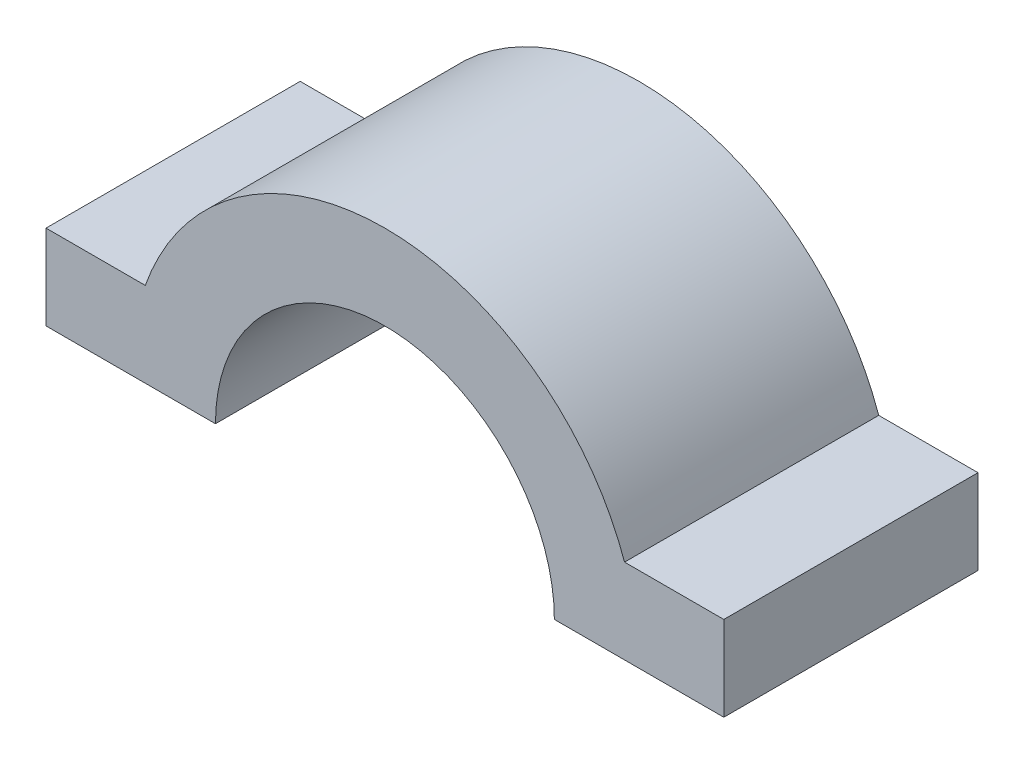
ISO-10303-21;
HEADER;
FILE_DESCRIPTION(('STEP AP214'),'2;1');
FILE_NAME('part.step','',(''),(''),'','','');
FILE_SCHEMA(('AUTOMOTIVE_DESIGN { 1 0 10303 214 1 1 1 1 }'));
ENDSEC;
DATA;
#1=APPLICATION_CONTEXT('core data for automotive mechanical design processes');
#2=APPLICATION_PROTOCOL_DEFINITION('international standard','automotive_design',2000,#1);
#3=PRODUCT_CONTEXT('',#1,'mechanical');
#4=PRODUCT('Part','Part','',(#3));
#5=PRODUCT_RELATED_PRODUCT_CATEGORY('part','',(#4));
#6=PRODUCT_DEFINITION_FORMATION('','',#4);
#7=PRODUCT_DEFINITION_CONTEXT('part definition',#1,'design');
#8=PRODUCT_DEFINITION('design','',#6,#7);
#9=PRODUCT_DEFINITION_SHAPE('','',#8);
#10=(LENGTH_UNIT() NAMED_UNIT(*) SI_UNIT(.MILLI.,.METRE.));
#11=(NAMED_UNIT(*) PLANE_ANGLE_UNIT() SI_UNIT($,.RADIAN.));
#12=(NAMED_UNIT(*) SI_UNIT($,.STERADIAN.) SOLID_ANGLE_UNIT());
#13=UNCERTAINTY_MEASURE_WITH_UNIT(LENGTH_MEASURE(1.E-05),#10,'distance_accuracy_value','');
#14=(GEOMETRIC_REPRESENTATION_CONTEXT(3) GLOBAL_UNCERTAINTY_ASSIGNED_CONTEXT((#13)) GLOBAL_UNIT_ASSIGNED_CONTEXT((#10,
#11,#12)) REPRESENTATION_CONTEXT('',''));
#15=CARTESIAN_POINT('',(0.,0.,0.));
#16=DIRECTION('',(0.,0.,1.));
#17=DIRECTION('',(1.,0.,0.));
#18=AXIS2_PLACEMENT_3D('',#15,#16,#17);
#19=CARTESIAN_POINT('',(0.,15.,15.));
#20=DIRECTION('',(0.,0.,-1.));
#21=DIRECTION('',(-1.,0.,0.));
#22=AXIS2_PLACEMENT_3D('',#19,#20,#21);
#23=PLANE('',#22);
#24=CARTESIAN_POINT('',(20.,0.,15.));
#25=DIRECTION('',(0.,0.,1.));
#26=DIRECTION('',(1.,0.,0.));
#27=AXIS2_PLACEMENT_3D('',#24,#25,#26);
#28=CIRCLE('',#27,15.);
#29=CARTESIAN_POINT('',(34.142135623731,5.,15.));
#30=VERTEX_POINT('',#29);
#31=CARTESIAN_POINT('',(5.85786437626904,5.,15.));
#32=VERTEX_POINT('',#31);
#33=EDGE_CURVE('E83',#30,#32,#28,.T.);
#34=ORIENTED_EDGE('',*,*,#33,.T.);
#35=DIRECTION('',(1.,0.,0.));
#36=VECTOR('',#35,1.);
#37=CARTESIAN_POINT('',(0.,5.,15.));
#38=LINE('',#37,#36);
#39=CARTESIAN_POINT('',(0.,5.,15.));
#40=VERTEX_POINT('',#39);
#41=EDGE_CURVE('E135',#40,#32,#38,.T.);
#42=ORIENTED_EDGE('',*,*,#41,.F.);
#43=DIRECTION('',(0.,-1.,0.));
#44=VECTOR('',#43,1.);
#45=CARTESIAN_POINT('',(0.,15.,15.));
#46=LINE('',#45,#44);
#47=CARTESIAN_POINT('',(0.,0.,15.));
#48=VERTEX_POINT('',#47);
#49=EDGE_CURVE('E12',#40,#48,#46,.T.);
#50=ORIENTED_EDGE('',*,*,#49,.T.);
#51=DIRECTION('',(1.,0.,0.));
#52=VECTOR('',#51,1.);
#53=CARTESIAN_POINT('',(0.,0.,15.));
#54=LINE('',#53,#52);
#55=CARTESIAN_POINT('',(10.,0.,15.));
#56=VERTEX_POINT('',#55);
#57=EDGE_CURVE('E169',#48,#56,#54,.T.);
#58=ORIENTED_EDGE('',*,*,#57,.T.);
#59=CARTESIAN_POINT('',(20.,0.,15.));
#60=DIRECTION('',(0.,0.,1.));
#61=DIRECTION('',(1.,0.,0.));
#62=AXIS2_PLACEMENT_3D('',#59,#60,#61);
#63=CIRCLE('',#62,10.);
#64=CARTESIAN_POINT('',(30.,0.,15.));
#65=VERTEX_POINT('',#64);
#66=EDGE_CURVE('E128',#65,#56,#63,.T.);
#67=ORIENTED_EDGE('',*,*,#66,.F.);
#68=CARTESIAN_POINT('',(40.,0.,15.));
#69=VERTEX_POINT('',#68);
#70=EDGE_CURVE('E168',#65,#69,#54,.T.);
#71=ORIENTED_EDGE('',*,*,#70,.T.);
#72=DIRECTION('',(0.,-1.,0.));
#73=VECTOR('',#72,1.);
#74=CARTESIAN_POINT('',(40.,15.,15.));
#75=LINE('',#74,#73);
#76=CARTESIAN_POINT('',(40.,5.,15.));
#77=VERTEX_POINT('',#76);
#78=EDGE_CURVE('E68',#77,#69,#75,.T.);
#79=ORIENTED_EDGE('',*,*,#78,.F.);
#80=DIRECTION('',(1.,0.,0.));
#81=VECTOR('',#80,1.);
#82=CARTESIAN_POINT('',(40.,5.,15.));
#83=LINE('',#82,#81);
#84=EDGE_CURVE('E158',#30,#77,#83,.T.);
#85=ORIENTED_EDGE('',*,*,#84,.F.);
#86=EDGE_LOOP('',(#34,#42,#50,#58,#67,#71,#79,#85));
#87=FACE_BOUND('',#86,.T.);
#88=ADVANCED_FACE('F59',(#87),#23,.F.);
#89=CARTESIAN_POINT('',(0.,15.,0.));
#90=DIRECTION('',(0.,0.,1.));
#91=DIRECTION('',(1.,0.,0.));
#92=AXIS2_PLACEMENT_3D('',#89,#90,#91);
#93=PLANE('',#92);
#94=DIRECTION('',(1.,0.,0.));
#95=VECTOR('',#94,1.);
#96=CARTESIAN_POINT('',(0.,5.,0.));
#97=LINE('',#96,#95);
#98=CARTESIAN_POINT('',(0.,5.,0.));
#99=VERTEX_POINT('',#98);
#100=CARTESIAN_POINT('',(5.85786437626904,5.,0.));
#101=VERTEX_POINT('',#100);
#102=EDGE_CURVE('E132',#99,#101,#97,.T.);
#103=ORIENTED_EDGE('',*,*,#102,.T.);
#104=CARTESIAN_POINT('',(20.,0.,0.));
#105=DIRECTION('',(0.,0.,1.));
#106=DIRECTION('',(1.,0.,0.));
#107=AXIS2_PLACEMENT_3D('',#104,#105,#106);
#108=CIRCLE('',#107,15.);
#109=CARTESIAN_POINT('',(34.142135623731,5.,0.));
#110=VERTEX_POINT('',#109);
#111=EDGE_CURVE('E75',#110,#101,#108,.T.);
#112=ORIENTED_EDGE('',*,*,#111,.F.);
#113=DIRECTION('',(1.,0.,0.));
#114=VECTOR('',#113,1.);
#115=CARTESIAN_POINT('',(40.,5.,0.));
#116=LINE('',#115,#114);
#117=CARTESIAN_POINT('',(40.,5.,0.));
#118=VERTEX_POINT('',#117);
#119=EDGE_CURVE('E155',#110,#118,#116,.T.);
#120=ORIENTED_EDGE('',*,*,#119,.T.);
#121=DIRECTION('',(0.,-1.,0.));
#122=VECTOR('',#121,1.);
#123=CARTESIAN_POINT('',(40.,15.,0.));
#124=LINE('',#123,#122);
#125=CARTESIAN_POINT('',(40.,0.,0.));
#126=VERTEX_POINT('',#125);
#127=EDGE_CURVE('E184',#118,#126,#124,.T.);
#128=ORIENTED_EDGE('',*,*,#127,.T.);
#129=DIRECTION('',(-1.,0.,0.));
#130=VECTOR('',#129,1.);
#131=CARTESIAN_POINT('',(0.,0.,0.));
#132=LINE('',#131,#130);
#133=CARTESIAN_POINT('',(30.,0.,0.));
#134=VERTEX_POINT('',#133);
#135=EDGE_CURVE('E178',#126,#134,#132,.T.);
#136=ORIENTED_EDGE('',*,*,#135,.T.);
#137=CARTESIAN_POINT('',(20.,0.,0.));
#138=DIRECTION('',(0.,0.,1.));
#139=DIRECTION('',(1.,0.,0.));
#140=AXIS2_PLACEMENT_3D('',#137,#138,#139);
#141=CIRCLE('',#140,10.);
#142=CARTESIAN_POINT('',(10.,0.,0.));
#143=VERTEX_POINT('',#142);
#144=EDGE_CURVE('E202',#134,#143,#141,.T.);
#145=ORIENTED_EDGE('',*,*,#144,.T.);
#146=CARTESIAN_POINT('',(0.,0.,0.));
#147=VERTEX_POINT('',#146);
#148=EDGE_CURVE('E177',#143,#147,#132,.T.);
#149=ORIENTED_EDGE('',*,*,#148,.T.);
#150=DIRECTION('',(0.,-1.,0.));
#151=VECTOR('',#150,1.);
#152=CARTESIAN_POINT('',(0.,15.,0.));
#153=LINE('',#152,#151);
#154=EDGE_CURVE('E141',#99,#147,#153,.T.);
#155=ORIENTED_EDGE('',*,*,#154,.F.);
#156=EDGE_LOOP('',(#103,#112,#120,#128,#136,#145,#149,#155));
#157=FACE_BOUND('',#156,.T.);
#158=ADVANCED_FACE('F139',(#157),#93,.F.);
#159=CARTESIAN_POINT('',(0.,0.,0.));
#160=DIRECTION('',(0.,1.,0.));
#161=DIRECTION('',(0.,0.,1.));
#162=AXIS2_PLACEMENT_3D('',#159,#160,#161);
#163=PLANE('',#162);
#164=ORIENTED_EDGE('',*,*,#148,.F.);
#165=DIRECTION('',(0.,0.,1.));
#166=VECTOR('',#165,1.);
#167=CARTESIAN_POINT('',(10.,0.,0.));
#168=LINE('',#167,#166);
#169=EDGE_CURVE('E161',#143,#56,#168,.T.);
#170=ORIENTED_EDGE('',*,*,#169,.T.);
#171=ORIENTED_EDGE('',*,*,#57,.F.);
#172=DIRECTION('',(0.,0.,1.));
#173=VECTOR('',#172,1.);
#174=CARTESIAN_POINT('',(0.,0.,0.));
#175=LINE('',#174,#173);
#176=EDGE_CURVE('E147',#147,#48,#175,.T.);
#177=ORIENTED_EDGE('',*,*,#176,.F.);
#178=EDGE_LOOP('',(#164,#170,#171,#177));
#179=FACE_BOUND('',#178,.T.);
#180=ADVANCED_FACE('F222',(#179),#163,.F.);
#181=CARTESIAN_POINT('',(0.,15.,0.));
#182=DIRECTION('',(1.,0.,0.));
#183=DIRECTION('',(0.,0.,-1.));
#184=AXIS2_PLACEMENT_3D('',#181,#182,#183);
#185=PLANE('',#184);
#186=ORIENTED_EDGE('',*,*,#49,.F.);
#187=DIRECTION('',(0.,0.,1.));
#188=VECTOR('',#187,1.);
#189=CARTESIAN_POINT('',(0.,5.,0.));
#190=LINE('',#189,#188);
#191=EDGE_CURVE('E143',#99,#40,#190,.T.);
#192=ORIENTED_EDGE('',*,*,#191,.F.);
#193=ORIENTED_EDGE('',*,*,#154,.T.);
#194=ORIENTED_EDGE('',*,*,#176,.T.);
#195=EDGE_LOOP('',(#186,#192,#193,#194));
#196=FACE_BOUND('',#195,.T.);
#197=ADVANCED_FACE('F61',(#196),#185,.F.);
#198=CARTESIAN_POINT('',(40.,15.,0.));
#199=DIRECTION('',(-1.,0.,0.));
#200=DIRECTION('',(0.,0.,1.));
#201=AXIS2_PLACEMENT_3D('',#198,#199,#200);
#202=PLANE('',#201);
#203=ORIENTED_EDGE('',*,*,#127,.F.);
#204=DIRECTION('',(0.,0.,1.));
#205=VECTOR('',#204,1.);
#206=CARTESIAN_POINT('',(40.,5.,0.));
#207=LINE('',#206,#205);
#208=EDGE_CURVE('E149',#118,#77,#207,.T.);
#209=ORIENTED_EDGE('',*,*,#208,.T.);
#210=ORIENTED_EDGE('',*,*,#78,.T.);
#211=DIRECTION('',(0.,0.,-1.));
#212=VECTOR('',#211,1.);
#213=CARTESIAN_POINT('',(40.,0.,0.));
#214=LINE('',#213,#212);
#215=EDGE_CURVE('E173',#69,#126,#214,.T.);
#216=ORIENTED_EDGE('',*,*,#215,.T.);
#217=EDGE_LOOP('',(#203,#209,#210,#216));
#218=FACE_BOUND('',#217,.T.);
#219=ADVANCED_FACE('F192',(#218),#202,.F.);
#220=ORIENTED_EDGE('',*,*,#70,.F.);
#221=DIRECTION('',(0.,0.,1.));
#222=VECTOR('',#221,1.);
#223=CARTESIAN_POINT('',(30.,0.,0.));
#224=LINE('',#223,#222);
#225=EDGE_CURVE('E152',#134,#65,#224,.T.);
#226=ORIENTED_EDGE('',*,*,#225,.F.);
#227=ORIENTED_EDGE('',*,*,#135,.F.);
#228=ORIENTED_EDGE('',*,*,#215,.F.);
#229=EDGE_LOOP('',(#220,#226,#227,#228));
#230=FACE_BOUND('',#229,.T.);
#231=ADVANCED_FACE('F199',(#230),#163,.F.);
#232=CARTESIAN_POINT('',(40.,5.,0.));
#233=DIRECTION('',(0.,-1.,0.));
#234=DIRECTION('',(0.,0.,-1.));
#235=AXIS2_PLACEMENT_3D('',#232,#233,#234);
#236=PLANE('',#235);
#237=ORIENTED_EDGE('',*,*,#119,.F.);
#238=DIRECTION('',(0.,0.,1.));
#239=VECTOR('',#238,1.);
#240=CARTESIAN_POINT('',(34.142135623731,5.,0.));
#241=LINE('',#240,#239);
#242=EDGE_CURVE('E126',#110,#30,#241,.T.);
#243=ORIENTED_EDGE('',*,*,#242,.T.);
#244=ORIENTED_EDGE('',*,*,#84,.T.);
#245=ORIENTED_EDGE('',*,*,#208,.F.);
#246=EDGE_LOOP('',(#237,#243,#244,#245));
#247=FACE_BOUND('',#246,.T.);
#248=ADVANCED_FACE('F205',(#247),#236,.F.);
#249=CARTESIAN_POINT('',(0.,5.,0.));
#250=DIRECTION('',(0.,-1.,0.));
#251=DIRECTION('',(0.,0.,-1.));
#252=AXIS2_PLACEMENT_3D('',#249,#250,#251);
#253=PLANE('',#252);
#254=ORIENTED_EDGE('',*,*,#41,.T.);
#255=DIRECTION('',(0.,0.,1.));
#256=VECTOR('',#255,1.);
#257=CARTESIAN_POINT('',(5.85786437626904,5.,0.));
#258=LINE('',#257,#256);
#259=EDGE_CURVE('E124',#101,#32,#258,.T.);
#260=ORIENTED_EDGE('',*,*,#259,.F.);
#261=ORIENTED_EDGE('',*,*,#102,.F.);
#262=ORIENTED_EDGE('',*,*,#191,.T.);
#263=EDGE_LOOP('',(#254,#260,#261,#262));
#264=FACE_BOUND('',#263,.T.);
#265=ADVANCED_FACE('F131',(#264),#253,.F.);
#266=CARTESIAN_POINT('',(20.,0.,0.));
#267=DIRECTION('',(0.,0.,1.));
#268=DIRECTION('',(1.,0.,0.));
#269=AXIS2_PLACEMENT_3D('',#266,#267,#268);
#270=CYLINDRICAL_SURFACE('',#269,10.);
#271=ORIENTED_EDGE('',*,*,#66,.T.);
#272=ORIENTED_EDGE('',*,*,#169,.F.);
#273=ORIENTED_EDGE('',*,*,#144,.F.);
#274=ORIENTED_EDGE('',*,*,#225,.T.);
#275=EDGE_LOOP('',(#271,#272,#273,#274));
#276=FACE_BOUND('',#275,.T.);
#277=ADVANCED_FACE('F220',(#276),#270,.F.);
#278=CARTESIAN_POINT('',(20.,0.,0.));
#279=DIRECTION('',(0.,0.,1.));
#280=DIRECTION('',(1.,0.,0.));
#281=AXIS2_PLACEMENT_3D('',#278,#279,#280);
#282=CYLINDRICAL_SURFACE('',#281,15.);
#283=ORIENTED_EDGE('',*,*,#33,.F.);
#284=ORIENTED_EDGE('',*,*,#242,.F.);
#285=ORIENTED_EDGE('',*,*,#111,.T.);
#286=ORIENTED_EDGE('',*,*,#259,.T.);
#287=EDGE_LOOP('',(#283,#284,#285,#286));
#288=FACE_BOUND('',#287,.T.);
#289=ADVANCED_FACE('F123',(#288),#282,.T.);
#290=CLOSED_SHELL('',(#88,#158,#180,#197,#219,#231,#248,#265,#277,#289));
#291=MANIFOLD_SOLID_BREP('B2',#290);
#292=ADVANCED_BREP_SHAPE_REPRESENTATION('',(#18,#291),#14);
#293=SHAPE_DEFINITION_REPRESENTATION(#9,#292);
ENDSEC;
END-ISO-10303-21;
